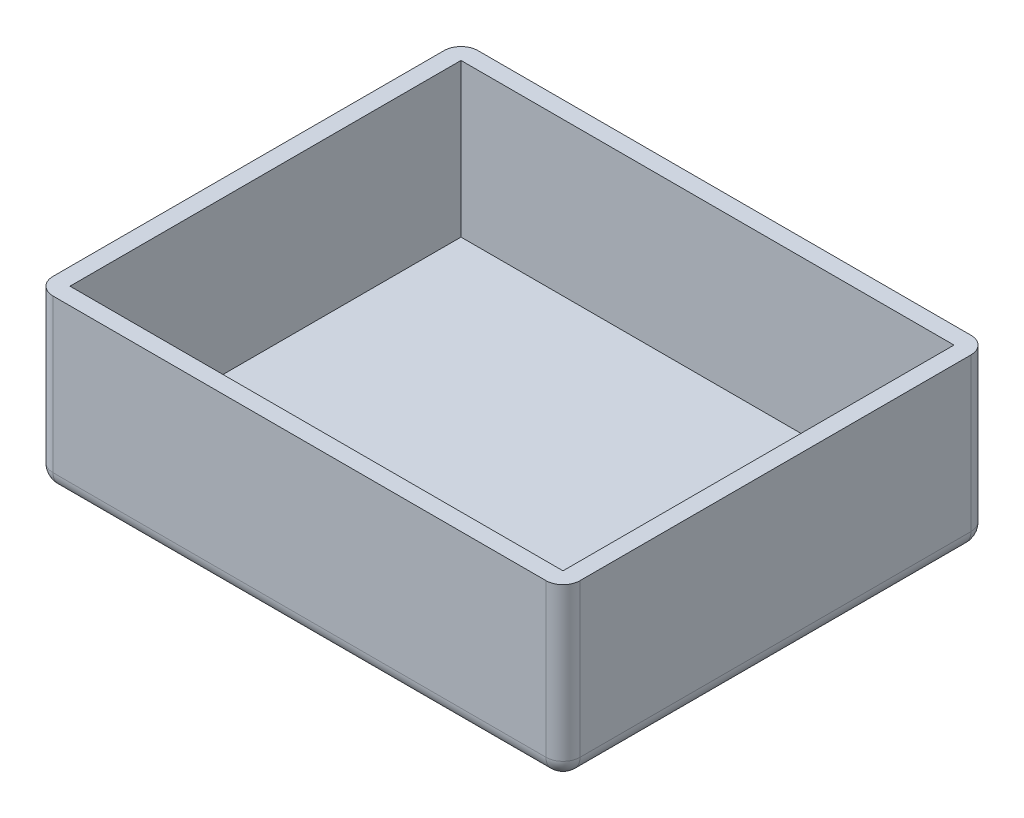
ISO-10303-21;
HEADER;
FILE_DESCRIPTION(('STEP AP214'),'2;1');
FILE_NAME('part.step','',(''),(''),'','','');
FILE_SCHEMA(('AUTOMOTIVE_DESIGN { 1 0 10303 214 1 1 1 1 }'));
ENDSEC;
DATA;
#1=APPLICATION_CONTEXT('core data for automotive mechanical design processes');
#2=APPLICATION_PROTOCOL_DEFINITION('international standard','automotive_design',2000,#1);
#3=PRODUCT_CONTEXT('',#1,'mechanical');
#4=PRODUCT('Part','Part','',(#3));
#5=PRODUCT_RELATED_PRODUCT_CATEGORY('part','',(#4));
#6=PRODUCT_DEFINITION_FORMATION('','',#4);
#7=PRODUCT_DEFINITION_CONTEXT('part definition',#1,'design');
#8=PRODUCT_DEFINITION('design','',#6,#7);
#9=PRODUCT_DEFINITION_SHAPE('','',#8);
#10=(LENGTH_UNIT() NAMED_UNIT(*) SI_UNIT(.MILLI.,.METRE.));
#11=(NAMED_UNIT(*) PLANE_ANGLE_UNIT() SI_UNIT($,.RADIAN.));
#12=(NAMED_UNIT(*) SI_UNIT($,.STERADIAN.) SOLID_ANGLE_UNIT());
#13=UNCERTAINTY_MEASURE_WITH_UNIT(LENGTH_MEASURE(1.E-05),#10,'distance_accuracy_value','');
#14=(GEOMETRIC_REPRESENTATION_CONTEXT(3) GLOBAL_UNCERTAINTY_ASSIGNED_CONTEXT((#13)) GLOBAL_UNIT_ASSIGNED_CONTEXT((#10,
#11,#12)) REPRESENTATION_CONTEXT('',''));
#15=CARTESIAN_POINT('',(0.,0.,0.));
#16=DIRECTION('',(0.,0.,1.));
#17=DIRECTION('',(1.,0.,0.));
#18=AXIS2_PLACEMENT_3D('',#15,#16,#17);
#19=CARTESIAN_POINT('',(-77.5,50.,-62.5));
#20=DIRECTION('',(1.,0.,0.));
#21=DIRECTION('',(0.,0.,-1.));
#22=AXIS2_PLACEMENT_3D('',#19,#20,#21);
#23=PLANE('',#22);
#24=DIRECTION('',(0.,0.,1.));
#25=VECTOR('',#24,1.);
#26=CARTESIAN_POINT('',(-77.5,50.,-62.5));
#27=LINE('',#26,#25);
#28=CARTESIAN_POINT('',(-77.5,50.,-57.5));
#29=VERTEX_POINT('',#28);
#30=CARTESIAN_POINT('',(-77.5,50.,57.5));
#31=VERTEX_POINT('',#30);
#32=EDGE_CURVE('E174',#29,#31,#27,.T.);
#33=ORIENTED_EDGE('',*,*,#32,.F.);
#34=DIRECTION('',(0.,-1.,0.));
#35=VECTOR('',#34,1.);
#36=CARTESIAN_POINT('',(-77.5,50.,-57.5));
#37=LINE('',#36,#35);
#38=CARTESIAN_POINT('',(-77.5,5.,-57.5));
#39=VERTEX_POINT('',#38);
#40=EDGE_CURVE('E50',#29,#39,#37,.T.);
#41=ORIENTED_EDGE('',*,*,#40,.T.);
#42=DIRECTION('',(0.,0.,1.));
#43=VECTOR('',#42,1.);
#44=CARTESIAN_POINT('',(-77.5,5.,-62.5));
#45=LINE('',#44,#43);
#46=CARTESIAN_POINT('',(-77.5,5.,57.5));
#47=VERTEX_POINT('',#46);
#48=EDGE_CURVE('E55',#39,#47,#45,.T.);
#49=ORIENTED_EDGE('',*,*,#48,.T.);
#50=DIRECTION('',(0.,-1.,0.));
#51=VECTOR('',#50,1.);
#52=CARTESIAN_POINT('',(-77.5,50.,57.5));
#53=LINE('',#52,#51);
#54=EDGE_CURVE('E217',#47,#31,#53,.F.);
#55=ORIENTED_EDGE('',*,*,#54,.T.);
#56=EDGE_LOOP('',(#33,#41,#49,#55));
#57=FACE_BOUND('',#56,.T.);
#58=ADVANCED_FACE('F33',(#57),#23,.F.);
#59=CARTESIAN_POINT('',(-77.5,50.,62.5));
#60=DIRECTION('',(0.,0.,-1.));
#61=DIRECTION('',(-1.,0.,0.));
#62=AXIS2_PLACEMENT_3D('',#59,#60,#61);
#63=PLANE('',#62);
#64=DIRECTION('',(1.,0.,0.));
#65=VECTOR('',#64,1.);
#66=CARTESIAN_POINT('',(-77.5,50.,62.5));
#67=LINE('',#66,#65);
#68=CARTESIAN_POINT('',(-72.5,50.,62.5));
#69=VERTEX_POINT('',#68);
#70=CARTESIAN_POINT('',(72.5,50.,62.5));
#71=VERTEX_POINT('',#70);
#72=EDGE_CURVE('E180',#69,#71,#67,.T.);
#73=ORIENTED_EDGE('',*,*,#72,.F.);
#74=DIRECTION('',(0.,-1.,0.));
#75=VECTOR('',#74,1.);
#76=CARTESIAN_POINT('',(-72.5,50.,62.5));
#77=LINE('',#76,#75);
#78=CARTESIAN_POINT('',(-72.5,5.,62.5));
#79=VERTEX_POINT('',#78);
#80=EDGE_CURVE('E194',#69,#79,#77,.T.);
#81=ORIENTED_EDGE('',*,*,#80,.T.);
#82=DIRECTION('',(1.,0.,0.));
#83=VECTOR('',#82,1.);
#84=CARTESIAN_POINT('',(-77.5,5.,62.5));
#85=LINE('',#84,#83);
#86=CARTESIAN_POINT('',(72.5,5.,62.5));
#87=VERTEX_POINT('',#86);
#88=EDGE_CURVE('E191',#79,#87,#85,.T.);
#89=ORIENTED_EDGE('',*,*,#88,.T.);
#90=DIRECTION('',(0.,-1.,0.));
#91=VECTOR('',#90,1.);
#92=CARTESIAN_POINT('',(72.5,50.,62.5));
#93=LINE('',#92,#91);
#94=EDGE_CURVE('E189',#87,#71,#93,.F.);
#95=ORIENTED_EDGE('',*,*,#94,.T.);
#96=EDGE_LOOP('',(#73,#81,#89,#95));
#97=FACE_BOUND('',#96,.T.);
#98=ADVANCED_FACE('F316',(#97),#63,.F.);
#99=CARTESIAN_POINT('',(77.5,50.,-62.5));
#100=DIRECTION('',(-1.,0.,0.));
#101=DIRECTION('',(0.,0.,1.));
#102=AXIS2_PLACEMENT_3D('',#99,#100,#101);
#103=PLANE('',#102);
#104=DIRECTION('',(0.,0.,-1.));
#105=VECTOR('',#104,1.);
#106=CARTESIAN_POINT('',(77.5,5.,-62.5));
#107=LINE('',#106,#105);
#108=CARTESIAN_POINT('',(77.5,5.,57.5));
#109=VERTEX_POINT('',#108);
#110=CARTESIAN_POINT('',(77.5,5.,-57.5));
#111=VERTEX_POINT('',#110);
#112=EDGE_CURVE('E207',#109,#111,#107,.T.);
#113=ORIENTED_EDGE('',*,*,#112,.T.);
#114=DIRECTION('',(0.,-1.,0.));
#115=VECTOR('',#114,1.);
#116=CARTESIAN_POINT('',(77.5,50.,-57.5));
#117=LINE('',#116,#115);
#118=CARTESIAN_POINT('',(77.5,50.,-57.5));
#119=VERTEX_POINT('',#118);
#120=EDGE_CURVE('E209',#111,#119,#117,.F.);
#121=ORIENTED_EDGE('',*,*,#120,.T.);
#122=DIRECTION('',(0.,0.,-1.));
#123=VECTOR('',#122,1.);
#124=CARTESIAN_POINT('',(77.5,50.,-62.5));
#125=LINE('',#124,#123);
#126=CARTESIAN_POINT('',(77.5,50.,57.5));
#127=VERTEX_POINT('',#126);
#128=EDGE_CURVE('E183',#127,#119,#125,.T.);
#129=ORIENTED_EDGE('',*,*,#128,.F.);
#130=DIRECTION('',(0.,-1.,0.));
#131=VECTOR('',#130,1.);
#132=CARTESIAN_POINT('',(77.5,50.,57.5));
#133=LINE('',#132,#131);
#134=EDGE_CURVE('E205',#127,#109,#133,.T.);
#135=ORIENTED_EDGE('',*,*,#134,.T.);
#136=EDGE_LOOP('',(#113,#121,#129,#135));
#137=FACE_BOUND('',#136,.T.);
#138=ADVANCED_FACE('F319',(#137),#103,.F.);
#139=CARTESIAN_POINT('',(-77.5,50.,-62.5));
#140=DIRECTION('',(0.,0.,1.));
#141=DIRECTION('',(1.,0.,0.));
#142=AXIS2_PLACEMENT_3D('',#139,#140,#141);
#143=PLANE('',#142);
#144=DIRECTION('',(-1.,0.,0.));
#145=VECTOR('',#144,1.);
#146=CARTESIAN_POINT('',(-77.5,5.,-62.5));
#147=LINE('',#146,#145);
#148=CARTESIAN_POINT('',(72.5,5.,-62.5));
#149=VERTEX_POINT('',#148);
#150=CARTESIAN_POINT('',(-72.5,5.,-62.5));
#151=VERTEX_POINT('',#150);
#152=EDGE_CURVE('E213',#149,#151,#147,.T.);
#153=ORIENTED_EDGE('',*,*,#152,.T.);
#154=DIRECTION('',(0.,-1.,0.));
#155=VECTOR('',#154,1.);
#156=CARTESIAN_POINT('',(-72.5,50.,-62.5));
#157=LINE('',#156,#155);
#158=CARTESIAN_POINT('',(-72.5,50.,-62.5));
#159=VERTEX_POINT('',#158);
#160=EDGE_CURVE('E215',#151,#159,#157,.F.);
#161=ORIENTED_EDGE('',*,*,#160,.T.);
#162=DIRECTION('',(-1.,0.,0.));
#163=VECTOR('',#162,1.);
#164=CARTESIAN_POINT('',(-77.5,50.,-62.5));
#165=LINE('',#164,#163);
#166=CARTESIAN_POINT('',(72.5,50.,-62.5));
#167=VERTEX_POINT('',#166);
#168=EDGE_CURVE('E186',#167,#159,#165,.T.);
#169=ORIENTED_EDGE('',*,*,#168,.F.);
#170=DIRECTION('',(0.,-1.,0.));
#171=VECTOR('',#170,1.);
#172=CARTESIAN_POINT('',(72.5,50.,-62.5));
#173=LINE('',#172,#171);
#174=EDGE_CURVE('E211',#167,#149,#173,.T.);
#175=ORIENTED_EDGE('',*,*,#174,.T.);
#176=EDGE_LOOP('',(#153,#161,#169,#175));
#177=FACE_BOUND('',#176,.T.);
#178=ADVANCED_FACE('F284',(#177),#143,.F.);
#179=CARTESIAN_POINT('',(0.,50.,0.));
#180=DIRECTION('',(0.,1.,0.));
#181=DIRECTION('',(0.,0.,1.));
#182=AXIS2_PLACEMENT_3D('',#179,#180,#181);
#183=PLANE('',#182);
#184=DIRECTION('',(0.,0.,1.));
#185=VECTOR('',#184,1.);
#186=CARTESIAN_POINT('',(-72.5,50.,-57.5));
#187=LINE('',#186,#185);
#188=CARTESIAN_POINT('',(-72.5,50.,-57.5));
#189=VERTEX_POINT('',#188);
#190=CARTESIAN_POINT('',(-72.5,50.,57.5));
#191=VERTEX_POINT('',#190);
#192=EDGE_CURVE('E142',#189,#191,#187,.T.);
#193=ORIENTED_EDGE('',*,*,#192,.F.);
#194=DIRECTION('',(-1.,0.,0.));
#195=VECTOR('',#194,1.);
#196=CARTESIAN_POINT('',(-72.5,50.,-57.5));
#197=LINE('',#196,#195);
#198=CARTESIAN_POINT('',(72.5,50.,-57.5));
#199=VERTEX_POINT('',#198);
#200=EDGE_CURVE('E159',#199,#189,#197,.T.);
#201=ORIENTED_EDGE('',*,*,#200,.F.);
#202=DIRECTION('',(0.,0.,-1.));
#203=VECTOR('',#202,1.);
#204=CARTESIAN_POINT('',(72.5,50.,-57.5));
#205=LINE('',#204,#203);
#206=CARTESIAN_POINT('',(72.5,50.,57.5));
#207=VERTEX_POINT('',#206);
#208=EDGE_CURVE('E162',#207,#199,#205,.T.);
#209=ORIENTED_EDGE('',*,*,#208,.F.);
#210=DIRECTION('',(1.,0.,0.));
#211=VECTOR('',#210,1.);
#212=CARTESIAN_POINT('',(-72.5,50.,57.5));
#213=LINE('',#212,#211);
#214=EDGE_CURVE('E168',#191,#207,#213,.T.);
#215=ORIENTED_EDGE('',*,*,#214,.F.);
#216=EDGE_LOOP('',(#193,#201,#209,#215));
#217=FACE_BOUND('',#216,.T.);
#218=ORIENTED_EDGE('',*,*,#168,.T.);
#219=CARTESIAN_POINT('',(-72.5,50.,-57.5));
#220=DIRECTION('',(0.,1.,0.));
#221=DIRECTION('',(0.,0.,1.));
#222=AXIS2_PLACEMENT_3D('',#219,#220,#221);
#223=CIRCLE('',#222,5.);
#224=EDGE_CURVE('E11',#159,#29,#223,.T.);
#225=ORIENTED_EDGE('',*,*,#224,.T.);
#226=ORIENTED_EDGE('',*,*,#32,.T.);
#227=CARTESIAN_POINT('',(-72.5,50.,57.5));
#228=DIRECTION('',(0.,1.,0.));
#229=DIRECTION('',(0.,0.,1.));
#230=AXIS2_PLACEMENT_3D('',#227,#228,#229);
#231=CIRCLE('',#230,5.);
#232=EDGE_CURVE('E42',#31,#69,#231,.T.);
#233=ORIENTED_EDGE('',*,*,#232,.T.);
#234=ORIENTED_EDGE('',*,*,#72,.T.);
#235=CARTESIAN_POINT('',(72.5,50.,57.5));
#236=DIRECTION('',(0.,1.,0.));
#237=DIRECTION('',(0.,0.,1.));
#238=AXIS2_PLACEMENT_3D('',#235,#236,#237);
#239=CIRCLE('',#238,5.);
#240=EDGE_CURVE('E221',#71,#127,#239,.T.);
#241=ORIENTED_EDGE('',*,*,#240,.T.);
#242=ORIENTED_EDGE('',*,*,#128,.T.);
#243=CARTESIAN_POINT('',(72.5,50.,-57.5));
#244=DIRECTION('',(0.,1.,0.));
#245=DIRECTION('',(0.,0.,1.));
#246=AXIS2_PLACEMENT_3D('',#243,#244,#245);
#247=CIRCLE('',#246,5.);
#248=EDGE_CURVE('E223',#119,#167,#247,.T.);
#249=ORIENTED_EDGE('',*,*,#248,.T.);
#250=EDGE_LOOP('',(#218,#225,#226,#233,#234,#241,#242,#249));
#251=FACE_BOUND('',#250,.T.);
#252=ADVANCED_FACE('F277',(#217,#251),#183,.T.);
#253=CARTESIAN_POINT('',(0.,0.,0.));
#254=DIRECTION('',(0.,1.,0.));
#255=DIRECTION('',(0.,0.,1.));
#256=AXIS2_PLACEMENT_3D('',#253,#254,#255);
#257=PLANE('',#256);
#258=DIRECTION('',(0.,0.,-1.));
#259=VECTOR('',#258,1.);
#260=CARTESIAN_POINT('',(72.5,0.,0.));
#261=LINE('',#260,#259);
#262=CARTESIAN_POINT('',(72.5,0.,-57.5));
#263=VERTEX_POINT('',#262);
#264=CARTESIAN_POINT('',(72.5,0.,57.5));
#265=VERTEX_POINT('',#264);
#266=EDGE_CURVE('E200',#263,#265,#261,.F.);
#267=ORIENTED_EDGE('',*,*,#266,.T.);
#268=DIRECTION('',(1.,0.,0.));
#269=VECTOR('',#268,1.);
#270=CARTESIAN_POINT('',(0.,0.,57.5));
#271=LINE('',#270,#269);
#272=CARTESIAN_POINT('',(-72.5,0.,57.5));
#273=VERTEX_POINT('',#272);
#274=EDGE_CURVE('E202',#265,#273,#271,.F.);
#275=ORIENTED_EDGE('',*,*,#274,.T.);
#276=DIRECTION('',(0.,0.,1.));
#277=VECTOR('',#276,1.);
#278=CARTESIAN_POINT('',(-72.5,0.,0.));
#279=LINE('',#278,#277);
#280=CARTESIAN_POINT('',(-72.5,0.,-57.5));
#281=VERTEX_POINT('',#280);
#282=EDGE_CURVE('E196',#273,#281,#279,.F.);
#283=ORIENTED_EDGE('',*,*,#282,.T.);
#284=DIRECTION('',(-1.,0.,0.));
#285=VECTOR('',#284,1.);
#286=CARTESIAN_POINT('',(0.,0.,-57.5));
#287=LINE('',#286,#285);
#288=EDGE_CURVE('E198',#281,#263,#287,.F.);
#289=ORIENTED_EDGE('',*,*,#288,.T.);
#290=EDGE_LOOP('',(#267,#275,#283,#289));
#291=FACE_BOUND('',#290,.T.);
#292=ADVANCED_FACE('F303',(#291),#257,.F.);
#293=CARTESIAN_POINT('',(-72.5,5.,-57.5));
#294=DIRECTION('',(-1.,0.,0.));
#295=DIRECTION('',(0.,0.,1.));
#296=AXIS2_PLACEMENT_3D('',#293,#294,#295);
#297=PLANE('',#296);
#298=ORIENTED_EDGE('',*,*,#192,.T.);
#299=DIRECTION('',(0.,1.,0.));
#300=VECTOR('',#299,1.);
#301=CARTESIAN_POINT('',(-72.5,5.,57.5));
#302=LINE('',#301,#300);
#303=CARTESIAN_POINT('',(-72.5,5.,57.5));
#304=VERTEX_POINT('',#303);
#305=EDGE_CURVE('E135',#304,#191,#302,.T.);
#306=ORIENTED_EDGE('',*,*,#305,.F.);
#307=DIRECTION('',(0.,0.,1.));
#308=VECTOR('',#307,1.);
#309=CARTESIAN_POINT('',(-72.5,5.,-57.5));
#310=LINE('',#309,#308);
#311=CARTESIAN_POINT('',(-72.5,5.,-57.5));
#312=VERTEX_POINT('',#311);
#313=EDGE_CURVE('E139',#312,#304,#310,.T.);
#314=ORIENTED_EDGE('',*,*,#313,.F.);
#315=DIRECTION('',(0.,1.,0.));
#316=VECTOR('',#315,1.);
#317=CARTESIAN_POINT('',(-72.5,5.,-57.5));
#318=LINE('',#317,#316);
#319=EDGE_CURVE('E172',#312,#189,#318,.T.);
#320=ORIENTED_EDGE('',*,*,#319,.T.);
#321=EDGE_LOOP('',(#298,#306,#314,#320));
#322=FACE_BOUND('',#321,.T.);
#323=ADVANCED_FACE('F137',(#322),#297,.F.);
#324=CARTESIAN_POINT('',(-72.5,5.,-57.5));
#325=DIRECTION('',(0.,0.,-1.));
#326=DIRECTION('',(-1.,0.,0.));
#327=AXIS2_PLACEMENT_3D('',#324,#325,#326);
#328=PLANE('',#327);
#329=ORIENTED_EDGE('',*,*,#200,.T.);
#330=ORIENTED_EDGE('',*,*,#319,.F.);
#331=DIRECTION('',(-1.,0.,0.));
#332=VECTOR('',#331,1.);
#333=CARTESIAN_POINT('',(-72.5,5.,-57.5));
#334=LINE('',#333,#332);
#335=CARTESIAN_POINT('',(72.5,5.,-57.5));
#336=VERTEX_POINT('',#335);
#337=EDGE_CURVE('E147',#336,#312,#334,.T.);
#338=ORIENTED_EDGE('',*,*,#337,.F.);
#339=DIRECTION('',(0.,1.,0.));
#340=VECTOR('',#339,1.);
#341=CARTESIAN_POINT('',(72.5,5.,-57.5));
#342=LINE('',#341,#340);
#343=EDGE_CURVE('E175',#336,#199,#342,.T.);
#344=ORIENTED_EDGE('',*,*,#343,.T.);
#345=EDGE_LOOP('',(#329,#330,#338,#344));
#346=FACE_BOUND('',#345,.T.);
#347=ADVANCED_FACE('F366',(#346),#328,.F.);
#348=CARTESIAN_POINT('',(72.5,5.,-57.5));
#349=DIRECTION('',(1.,0.,0.));
#350=DIRECTION('',(0.,0.,-1.));
#351=AXIS2_PLACEMENT_3D('',#348,#349,#350);
#352=PLANE('',#351);
#353=ORIENTED_EDGE('',*,*,#208,.T.);
#354=ORIENTED_EDGE('',*,*,#343,.F.);
#355=DIRECTION('',(0.,0.,-1.));
#356=VECTOR('',#355,1.);
#357=CARTESIAN_POINT('',(72.5,5.,-57.5));
#358=LINE('',#357,#356);
#359=CARTESIAN_POINT('',(72.5,5.,57.5));
#360=VERTEX_POINT('',#359);
#361=EDGE_CURVE('E155',#360,#336,#358,.T.);
#362=ORIENTED_EDGE('',*,*,#361,.F.);
#363=DIRECTION('',(0.,1.,0.));
#364=VECTOR('',#363,1.);
#365=CARTESIAN_POINT('',(72.5,5.,57.5));
#366=LINE('',#365,#364);
#367=EDGE_CURVE('E146',#360,#207,#366,.T.);
#368=ORIENTED_EDGE('',*,*,#367,.T.);
#369=EDGE_LOOP('',(#353,#354,#362,#368));
#370=FACE_BOUND('',#369,.T.);
#371=ADVANCED_FACE('F363',(#370),#352,.F.);
#372=CARTESIAN_POINT('',(-72.5,5.,57.5));
#373=DIRECTION('',(0.,0.,1.));
#374=DIRECTION('',(1.,0.,0.));
#375=AXIS2_PLACEMENT_3D('',#372,#373,#374);
#376=PLANE('',#375);
#377=ORIENTED_EDGE('',*,*,#214,.T.);
#378=ORIENTED_EDGE('',*,*,#367,.F.);
#379=DIRECTION('',(1.,0.,0.));
#380=VECTOR('',#379,1.);
#381=CARTESIAN_POINT('',(-72.5,5.,57.5));
#382=LINE('',#381,#380);
#383=EDGE_CURVE('E150',#304,#360,#382,.T.);
#384=ORIENTED_EDGE('',*,*,#383,.F.);
#385=ORIENTED_EDGE('',*,*,#305,.T.);
#386=EDGE_LOOP('',(#377,#378,#384,#385));
#387=FACE_BOUND('',#386,.T.);
#388=ADVANCED_FACE('F151',(#387),#376,.F.);
#389=CARTESIAN_POINT('',(0.,5.,0.));
#390=DIRECTION('',(0.,1.,0.));
#391=DIRECTION('',(0.,0.,1.));
#392=AXIS2_PLACEMENT_3D('',#389,#390,#391);
#393=PLANE('',#392);
#394=ORIENTED_EDGE('',*,*,#313,.T.);
#395=ORIENTED_EDGE('',*,*,#383,.T.);
#396=ORIENTED_EDGE('',*,*,#361,.T.);
#397=ORIENTED_EDGE('',*,*,#337,.T.);
#398=EDGE_LOOP('',(#394,#395,#396,#397));
#399=FACE_BOUND('',#398,.T.);
#400=ADVANCED_FACE('F157',(#399),#393,.T.);
#401=CARTESIAN_POINT('',(-72.5,50.,-57.5));
#402=DIRECTION('',(0.,-1.,0.));
#403=DIRECTION('',(0.,0.,-1.));
#404=AXIS2_PLACEMENT_3D('',#401,#402,#403);
#405=CYLINDRICAL_SURFACE('',#404,5.);
#406=ORIENTED_EDGE('',*,*,#224,.F.);
#407=ORIENTED_EDGE('',*,*,#160,.F.);
#408=CARTESIAN_POINT('',(-72.5,5.,-57.5));
#409=DIRECTION('',(0.,-1.,0.));
#410=DIRECTION('',(0.,0.,-1.));
#411=AXIS2_PLACEMENT_3D('',#408,#409,#410);
#412=CIRCLE('',#411,5.);
#413=EDGE_CURVE('E253',#39,#151,#412,.T.);
#414=ORIENTED_EDGE('',*,*,#413,.F.);
#415=ORIENTED_EDGE('',*,*,#40,.F.);
#416=EDGE_LOOP('',(#406,#407,#414,#415));
#417=FACE_BOUND('',#416,.T.);
#418=ADVANCED_FACE('F35',(#417),#405,.T.);
#419=CARTESIAN_POINT('',(72.5,50.,-57.5));
#420=DIRECTION('',(0.,-1.,0.));
#421=DIRECTION('',(0.,0.,-1.));
#422=AXIS2_PLACEMENT_3D('',#419,#420,#421);
#423=CYLINDRICAL_SURFACE('',#422,5.);
#424=ORIENTED_EDGE('',*,*,#248,.F.);
#425=ORIENTED_EDGE('',*,*,#120,.F.);
#426=CARTESIAN_POINT('',(72.5,5.,-57.5));
#427=DIRECTION('',(0.,-1.,0.));
#428=DIRECTION('',(0.,0.,-1.));
#429=AXIS2_PLACEMENT_3D('',#426,#427,#428);
#430=CIRCLE('',#429,5.);
#431=EDGE_CURVE('E251',#149,#111,#430,.T.);
#432=ORIENTED_EDGE('',*,*,#431,.F.);
#433=ORIENTED_EDGE('',*,*,#174,.F.);
#434=EDGE_LOOP('',(#424,#425,#432,#433));
#435=FACE_BOUND('',#434,.T.);
#436=ADVANCED_FACE('F293',(#435),#423,.T.);
#437=CARTESIAN_POINT('',(-77.5,5.,-57.5));
#438=DIRECTION('',(-1.,0.,0.));
#439=DIRECTION('',(0.,0.,1.));
#440=AXIS2_PLACEMENT_3D('',#437,#438,#439);
#441=CYLINDRICAL_SURFACE('',#440,5.);
#442=CARTESIAN_POINT('',(-72.5,5.,-57.5));
#443=DIRECTION('',(-1.,0.,0.));
#444=DIRECTION('',(0.,0.,1.));
#445=AXIS2_PLACEMENT_3D('',#442,#443,#444);
#446=CIRCLE('',#445,5.);
#447=EDGE_CURVE('E37',#151,#281,#446,.T.);
#448=ORIENTED_EDGE('',*,*,#447,.F.);
#449=ORIENTED_EDGE('',*,*,#152,.F.);
#450=CARTESIAN_POINT('',(72.5,5.,-57.5));
#451=DIRECTION('',(1.,0.,0.));
#452=DIRECTION('',(0.,0.,-1.));
#453=AXIS2_PLACEMENT_3D('',#450,#451,#452);
#454=CIRCLE('',#453,5.);
#455=EDGE_CURVE('E248',#263,#149,#454,.T.);
#456=ORIENTED_EDGE('',*,*,#455,.F.);
#457=ORIENTED_EDGE('',*,*,#288,.F.);
#458=EDGE_LOOP('',(#448,#449,#456,#457));
#459=FACE_BOUND('',#458,.T.);
#460=ADVANCED_FACE('F288',(#459),#441,.T.);
#461=CARTESIAN_POINT('',(-72.5,5.,-57.5));
#462=DIRECTION('',(0.,0.,1.));
#463=DIRECTION('',(1.,0.,0.));
#464=AXIS2_PLACEMENT_3D('',#461,#462,#463);
#465=SPHERICAL_SURFACE('',#464,5.);
#466=ORIENTED_EDGE('',*,*,#413,.T.);
#467=ORIENTED_EDGE('',*,*,#447,.T.);
#468=CARTESIAN_POINT('',(-72.5,5.,-57.5));
#469=DIRECTION('',(0.,0.,-1.));
#470=DIRECTION('',(-1.,0.,0.));
#471=AXIS2_PLACEMENT_3D('',#468,#469,#470);
#472=CIRCLE('',#471,5.);
#473=EDGE_CURVE('E245',#39,#281,#472,.F.);
#474=ORIENTED_EDGE('',*,*,#473,.F.);
#475=EDGE_LOOP('',(#466,#467,#474));
#476=FACE_BOUND('',#475,.T.);
#477=ADVANCED_FACE('F259',(#476),#465,.T.);
#478=CARTESIAN_POINT('',(72.5,5.,-57.5));
#479=DIRECTION('',(0.,0.,1.));
#480=DIRECTION('',(1.,0.,0.));
#481=AXIS2_PLACEMENT_3D('',#478,#479,#480);
#482=SPHERICAL_SURFACE('',#481,5.);
#483=ORIENTED_EDGE('',*,*,#455,.T.);
#484=ORIENTED_EDGE('',*,*,#431,.T.);
#485=CARTESIAN_POINT('',(72.5,5.,-57.5));
#486=DIRECTION('',(0.,0.,-1.));
#487=DIRECTION('',(-1.,0.,0.));
#488=AXIS2_PLACEMENT_3D('',#485,#486,#487);
#489=CIRCLE('',#488,5.);
#490=EDGE_CURVE('E242',#263,#111,#489,.F.);
#491=ORIENTED_EDGE('',*,*,#490,.F.);
#492=EDGE_LOOP('',(#483,#484,#491));
#493=FACE_BOUND('',#492,.T.);
#494=ADVANCED_FACE('F295',(#493),#482,.T.);
#495=CARTESIAN_POINT('',(-72.5,5.,-62.5));
#496=DIRECTION('',(0.,0.,1.));
#497=DIRECTION('',(1.,0.,0.));
#498=AXIS2_PLACEMENT_3D('',#495,#496,#497);
#499=CYLINDRICAL_SURFACE('',#498,5.);
#500=ORIENTED_EDGE('',*,*,#473,.T.);
#501=ORIENTED_EDGE('',*,*,#282,.F.);
#502=CARTESIAN_POINT('',(-72.5,5.,57.5));
#503=DIRECTION('',(0.,0.,1.));
#504=DIRECTION('',(1.,0.,0.));
#505=AXIS2_PLACEMENT_3D('',#502,#503,#504);
#506=CIRCLE('',#505,5.);
#507=EDGE_CURVE('E239',#47,#273,#506,.T.);
#508=ORIENTED_EDGE('',*,*,#507,.F.);
#509=ORIENTED_EDGE('',*,*,#48,.F.);
#510=EDGE_LOOP('',(#500,#501,#508,#509));
#511=FACE_BOUND('',#510,.T.);
#512=ADVANCED_FACE('F265',(#511),#499,.T.);
#513=CARTESIAN_POINT('',(-72.5,50.,57.5));
#514=DIRECTION('',(0.,-1.,0.));
#515=DIRECTION('',(0.,0.,-1.));
#516=AXIS2_PLACEMENT_3D('',#513,#514,#515);
#517=CYLINDRICAL_SURFACE('',#516,5.);
#518=ORIENTED_EDGE('',*,*,#232,.F.);
#519=ORIENTED_EDGE('',*,*,#54,.F.);
#520=CARTESIAN_POINT('',(-72.5,5.,57.5));
#521=DIRECTION('',(0.,-1.,0.));
#522=DIRECTION('',(0.,0.,-1.));
#523=AXIS2_PLACEMENT_3D('',#520,#521,#522);
#524=CIRCLE('',#523,5.);
#525=EDGE_CURVE('E236',#79,#47,#524,.T.);
#526=ORIENTED_EDGE('',*,*,#525,.F.);
#527=ORIENTED_EDGE('',*,*,#80,.F.);
#528=EDGE_LOOP('',(#518,#519,#526,#527));
#529=FACE_BOUND('',#528,.T.);
#530=ADVANCED_FACE('F275',(#529),#517,.T.);
#531=CARTESIAN_POINT('',(72.5,50.,57.5));
#532=DIRECTION('',(0.,-1.,0.));
#533=DIRECTION('',(0.,0.,-1.));
#534=AXIS2_PLACEMENT_3D('',#531,#532,#533);
#535=CYLINDRICAL_SURFACE('',#534,5.);
#536=ORIENTED_EDGE('',*,*,#240,.F.);
#537=ORIENTED_EDGE('',*,*,#94,.F.);
#538=CARTESIAN_POINT('',(72.5,5.,57.5));
#539=DIRECTION('',(0.,-1.,0.));
#540=DIRECTION('',(0.,0.,-1.));
#541=AXIS2_PLACEMENT_3D('',#538,#539,#540);
#542=CIRCLE('',#541,5.);
#543=EDGE_CURVE('E233',#109,#87,#542,.T.);
#544=ORIENTED_EDGE('',*,*,#543,.F.);
#545=ORIENTED_EDGE('',*,*,#134,.F.);
#546=EDGE_LOOP('',(#536,#537,#544,#545));
#547=FACE_BOUND('',#546,.T.);
#548=ADVANCED_FACE('F314',(#547),#535,.T.);
#549=CARTESIAN_POINT('',(72.5,5.,-62.5));
#550=DIRECTION('',(0.,0.,-1.));
#551=DIRECTION('',(-1.,0.,0.));
#552=AXIS2_PLACEMENT_3D('',#549,#550,#551);
#553=CYLINDRICAL_SURFACE('',#552,5.);
#554=ORIENTED_EDGE('',*,*,#490,.T.);
#555=ORIENTED_EDGE('',*,*,#112,.F.);
#556=CARTESIAN_POINT('',(72.5,5.,57.5));
#557=DIRECTION('',(0.,0.,1.));
#558=DIRECTION('',(1.,0.,0.));
#559=AXIS2_PLACEMENT_3D('',#556,#557,#558);
#560=CIRCLE('',#559,5.);
#561=EDGE_CURVE('E230',#265,#109,#560,.T.);
#562=ORIENTED_EDGE('',*,*,#561,.F.);
#563=ORIENTED_EDGE('',*,*,#266,.F.);
#564=EDGE_LOOP('',(#554,#555,#562,#563));
#565=FACE_BOUND('',#564,.T.);
#566=ADVANCED_FACE('F300',(#565),#553,.T.);
#567=CARTESIAN_POINT('',(-72.5,5.,57.5));
#568=DIRECTION('',(0.,0.,1.));
#569=DIRECTION('',(1.,0.,0.));
#570=AXIS2_PLACEMENT_3D('',#567,#568,#569);
#571=SPHERICAL_SURFACE('',#570,5.);
#572=ORIENTED_EDGE('',*,*,#525,.T.);
#573=ORIENTED_EDGE('',*,*,#507,.T.);
#574=CARTESIAN_POINT('',(-72.5,5.,57.5));
#575=DIRECTION('',(-1.,0.,0.));
#576=DIRECTION('',(0.,0.,1.));
#577=AXIS2_PLACEMENT_3D('',#574,#575,#576);
#578=CIRCLE('',#577,5.);
#579=EDGE_CURVE('E228',#79,#273,#578,.F.);
#580=ORIENTED_EDGE('',*,*,#579,.F.);
#581=EDGE_LOOP('',(#572,#573,#580));
#582=FACE_BOUND('',#581,.T.);
#583=ADVANCED_FACE('F270',(#582),#571,.T.);
#584=CARTESIAN_POINT('',(72.5,5.,57.5));
#585=DIRECTION('',(0.,0.,1.));
#586=DIRECTION('',(1.,0.,0.));
#587=AXIS2_PLACEMENT_3D('',#584,#585,#586);
#588=SPHERICAL_SURFACE('',#587,5.);
#589=ORIENTED_EDGE('',*,*,#561,.T.);
#590=ORIENTED_EDGE('',*,*,#543,.T.);
#591=CARTESIAN_POINT('',(72.5,5.,57.5));
#592=DIRECTION('',(1.,0.,0.));
#593=DIRECTION('',(0.,0.,-1.));
#594=AXIS2_PLACEMENT_3D('',#591,#592,#593);
#595=CIRCLE('',#594,5.);
#596=EDGE_CURVE('E226',#265,#87,#595,.F.);
#597=ORIENTED_EDGE('',*,*,#596,.F.);
#598=EDGE_LOOP('',(#589,#590,#597));
#599=FACE_BOUND('',#598,.T.);
#600=ADVANCED_FACE('F308',(#599),#588,.T.);
#601=CARTESIAN_POINT('',(-77.5,5.,57.5));
#602=DIRECTION('',(1.,0.,0.));
#603=DIRECTION('',(0.,0.,-1.));
#604=AXIS2_PLACEMENT_3D('',#601,#602,#603);
#605=CYLINDRICAL_SURFACE('',#604,5.);
#606=ORIENTED_EDGE('',*,*,#579,.T.);
#607=ORIENTED_EDGE('',*,*,#274,.F.);
#608=ORIENTED_EDGE('',*,*,#596,.T.);
#609=ORIENTED_EDGE('',*,*,#88,.F.);
#610=EDGE_LOOP('',(#606,#607,#608,#609));
#611=FACE_BOUND('',#610,.T.);
#612=ADVANCED_FACE('F306',(#611),#605,.T.);
#613=CLOSED_SHELL('',(#58,#98,#138,#178,#252,#292,#323,#347,#371,#388,#400,#418,#436,#460,#477,
#494,#512,#530,#548,#566,#583,#600,#612));
#614=MANIFOLD_SOLID_BREP('B2',#613);
#615=ADVANCED_BREP_SHAPE_REPRESENTATION('',(#18,#614),#14);
#616=SHAPE_DEFINITION_REPRESENTATION(#9,#615);
ENDSEC;
END-ISO-10303-21;
